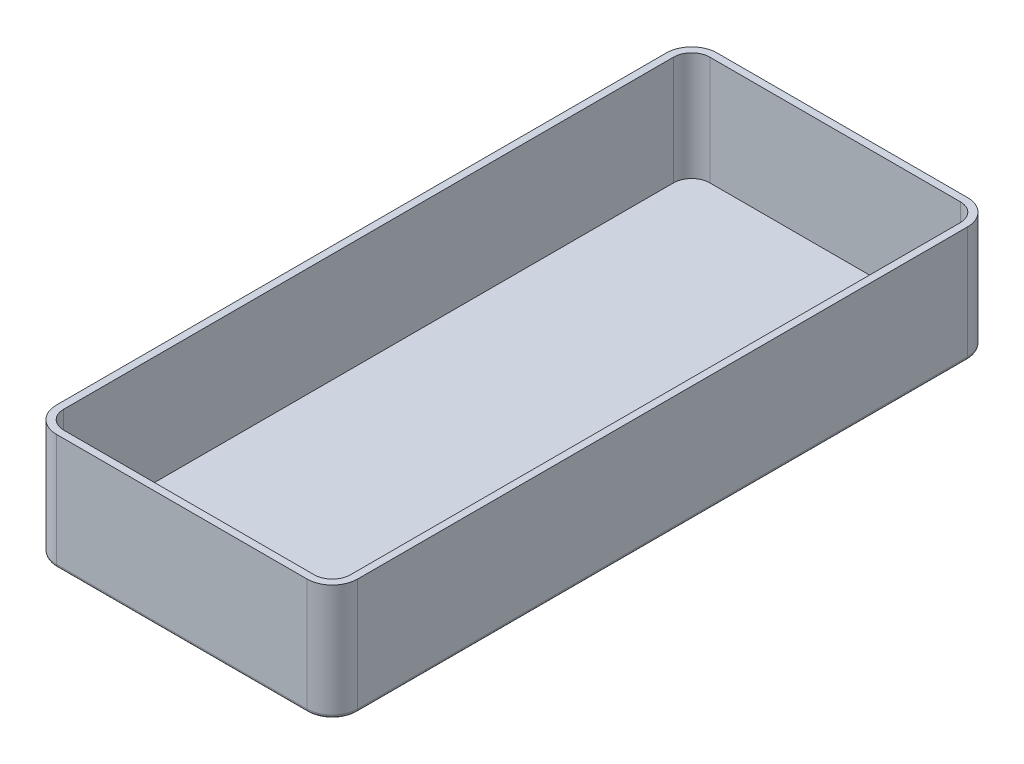
ISO-10303-21;
HEADER;
FILE_DESCRIPTION(('STEP AP214'),'2;1');
FILE_NAME('part.step','',(''),(''),'','','');
FILE_SCHEMA(('AUTOMOTIVE_DESIGN { 1 0 10303 214 1 1 1 1 }'));
ENDSEC;
DATA;
#1=APPLICATION_CONTEXT('core data for automotive mechanical design processes');
#2=APPLICATION_PROTOCOL_DEFINITION('international standard','automotive_design',2000,#1);
#3=PRODUCT_CONTEXT('',#1,'mechanical');
#4=PRODUCT('Part','Part','',(#3));
#5=PRODUCT_RELATED_PRODUCT_CATEGORY('part','',(#4));
#6=PRODUCT_DEFINITION_FORMATION('','',#4);
#7=PRODUCT_DEFINITION_CONTEXT('part definition',#1,'design');
#8=PRODUCT_DEFINITION('design','',#6,#7);
#9=PRODUCT_DEFINITION_SHAPE('','',#8);
#10=(LENGTH_UNIT() NAMED_UNIT(*) SI_UNIT(.MILLI.,.METRE.));
#11=(NAMED_UNIT(*) PLANE_ANGLE_UNIT() SI_UNIT($,.RADIAN.));
#12=(NAMED_UNIT(*) SI_UNIT($,.STERADIAN.) SOLID_ANGLE_UNIT());
#13=UNCERTAINTY_MEASURE_WITH_UNIT(LENGTH_MEASURE(1.E-05),#10,'distance_accuracy_value','');
#14=(GEOMETRIC_REPRESENTATION_CONTEXT(3) GLOBAL_UNCERTAINTY_ASSIGNED_CONTEXT((#13)) GLOBAL_UNIT_ASSIGNED_CONTEXT((#10,
#11,#12)) REPRESENTATION_CONTEXT('',''));
#15=CARTESIAN_POINT('',(0.,0.,0.));
#16=DIRECTION('',(0.,0.,1.));
#17=DIRECTION('',(1.,0.,0.));
#18=AXIS2_PLACEMENT_3D('',#15,#16,#17);
#19=CARTESIAN_POINT('',(-76.,32.,-6.99999999999999));
#20=DIRECTION('',(0.,-1.,0.));
#21=DIRECTION('',(0.,0.,-1.));
#22=AXIS2_PLACEMENT_3D('',#19,#20,#21);
#23=PLANE('',#22);
#24=CARTESIAN_POINT('',(-76.,32.,-6.99999999999999));
#25=DIRECTION('',(0.,1.,0.));
#26=DIRECTION('',(0.,0.,-1.));
#27=AXIS2_PLACEMENT_3D('',#24,#25,#26);
#28=CIRCLE('',#27,7.);
#29=CARTESIAN_POINT('',(-83.,32.,-7.00000000000004));
#30=VERTEX_POINT('',#29);
#31=CARTESIAN_POINT('',(-76.,32.,0.));
#32=VERTEX_POINT('',#31);
#33=EDGE_CURVE('E245',#30,#32,#28,.T.);
#34=ORIENTED_EDGE('',*,*,#33,.T.);
#35=DIRECTION('',(1.,0.,0.));
#36=VECTOR('',#35,1.);
#37=CARTESIAN_POINT('',(-7.00000000000005,32.,0.));
#38=LINE('',#37,#36);
#39=CARTESIAN_POINT('',(-7.00000000000005,32.,0.));
#40=VERTEX_POINT('',#39);
#41=EDGE_CURVE('E248',#32,#40,#38,.T.);
#42=ORIENTED_EDGE('',*,*,#41,.T.);
#43=CARTESIAN_POINT('',(-7.,32.,-7.));
#44=DIRECTION('',(0.,1.,0.));
#45=DIRECTION('',(0.,0.,1.));
#46=AXIS2_PLACEMENT_3D('',#43,#44,#45);
#47=CIRCLE('',#46,7.);
#48=CARTESIAN_POINT('',(0.,32.,-7.00000000000005));
#49=VERTEX_POINT('',#48);
#50=EDGE_CURVE('E250',#40,#49,#47,.T.);
#51=ORIENTED_EDGE('',*,*,#50,.T.);
#52=DIRECTION('',(0.,0.,-1.));
#53=VECTOR('',#52,1.);
#54=CARTESIAN_POINT('',(0.,32.,-7.00000000000005));
#55=LINE('',#54,#53);
#56=CARTESIAN_POINT('',(0.,32.,-175.));
#57=VERTEX_POINT('',#56);
#58=EDGE_CURVE('E252',#49,#57,#55,.T.);
#59=ORIENTED_EDGE('',*,*,#58,.T.);
#60=CARTESIAN_POINT('',(-7.,32.,-175.));
#61=DIRECTION('',(0.,1.,0.));
#62=DIRECTION('',(0.,0.,1.));
#63=AXIS2_PLACEMENT_3D('',#60,#61,#62);
#64=CIRCLE('',#63,7.);
#65=CARTESIAN_POINT('',(-7.00000000000005,32.,-182.));
#66=VERTEX_POINT('',#65);
#67=EDGE_CURVE('E254',#57,#66,#64,.T.);
#68=ORIENTED_EDGE('',*,*,#67,.T.);
#69=DIRECTION('',(-1.,0.,0.));
#70=VECTOR('',#69,1.);
#71=CARTESIAN_POINT('',(-7.00000000000005,32.,-182.));
#72=LINE('',#71,#70);
#73=CARTESIAN_POINT('',(-76.,32.,-182.));
#74=VERTEX_POINT('',#73);
#75=EDGE_CURVE('E256',#66,#74,#72,.T.);
#76=ORIENTED_EDGE('',*,*,#75,.T.);
#77=CARTESIAN_POINT('',(-76.,32.,-175.));
#78=DIRECTION('',(0.,1.,0.));
#79=DIRECTION('',(0.,0.,1.));
#80=AXIS2_PLACEMENT_3D('',#77,#78,#79);
#81=CIRCLE('',#80,7.00000000000001);
#82=CARTESIAN_POINT('',(-83.,32.,-175.));
#83=VERTEX_POINT('',#82);
#84=EDGE_CURVE('E258',#74,#83,#81,.T.);
#85=ORIENTED_EDGE('',*,*,#84,.T.);
#86=DIRECTION('',(0.,0.,1.));
#87=VECTOR('',#86,1.);
#88=CARTESIAN_POINT('',(-83.,32.,-7.00000000000004));
#89=LINE('',#88,#87);
#90=EDGE_CURVE('E260',#83,#30,#89,.T.);
#91=ORIENTED_EDGE('',*,*,#90,.T.);
#92=EDGE_LOOP('',(#34,#42,#51,#59,#68,#76,#85,#91));
#93=FACE_BOUND('',#92,.T.);
#94=CARTESIAN_POINT('',(-76.,32.,-6.99999999999999));
#95=DIRECTION('',(0.,-1.,0.));
#96=DIRECTION('',(0.,0.,-1.));
#97=AXIS2_PLACEMENT_3D('',#94,#95,#96);
#98=CIRCLE('',#97,5.);
#99=CARTESIAN_POINT('',(-81.,32.,-7.00000000000004));
#100=VERTEX_POINT('',#99);
#101=CARTESIAN_POINT('',(-76.,32.,-1.99999999999999));
#102=VERTEX_POINT('',#101);
#103=EDGE_CURVE('E232',#100,#102,#98,.F.);
#104=ORIENTED_EDGE('',*,*,#103,.F.);
#105=DIRECTION('',(0.,0.,1.));
#106=VECTOR('',#105,1.);
#107=CARTESIAN_POINT('',(-81.,32.,-6.99999999999999));
#108=LINE('',#107,#106);
#109=CARTESIAN_POINT('',(-81.,32.,-175.));
#110=VERTEX_POINT('',#109);
#111=EDGE_CURVE('E199',#110,#100,#108,.T.);
#112=ORIENTED_EDGE('',*,*,#111,.F.);
#113=CARTESIAN_POINT('',(-76.,32.,-175.));
#114=DIRECTION('',(0.,-1.,0.));
#115=DIRECTION('',(0.,0.,-1.));
#116=AXIS2_PLACEMENT_3D('',#113,#114,#115);
#117=CIRCLE('',#116,5.00000000000001);
#118=CARTESIAN_POINT('',(-76.,32.,-180.));
#119=VERTEX_POINT('',#118);
#120=EDGE_CURVE('E203',#119,#110,#117,.F.);
#121=ORIENTED_EDGE('',*,*,#120,.F.);
#122=DIRECTION('',(-1.,0.,0.));
#123=VECTOR('',#122,1.);
#124=CARTESIAN_POINT('',(-76.,32.,-180.));
#125=LINE('',#124,#123);
#126=CARTESIAN_POINT('',(-7.00000000000004,32.,-180.));
#127=VERTEX_POINT('',#126);
#128=EDGE_CURVE('E242',#127,#119,#125,.T.);
#129=ORIENTED_EDGE('',*,*,#128,.F.);
#130=CARTESIAN_POINT('',(-7.,32.,-175.));
#131=DIRECTION('',(0.,-1.,0.));
#132=DIRECTION('',(0.,0.,-1.));
#133=AXIS2_PLACEMENT_3D('',#130,#131,#132);
#134=CIRCLE('',#133,5.);
#135=CARTESIAN_POINT('',(-2.,32.,-175.));
#136=VERTEX_POINT('',#135);
#137=EDGE_CURVE('E240',#136,#127,#134,.F.);
#138=ORIENTED_EDGE('',*,*,#137,.F.);
#139=DIRECTION('',(0.,0.,-1.));
#140=VECTOR('',#139,1.);
#141=CARTESIAN_POINT('',(-2.,32.,-6.99999999999999));
#142=LINE('',#141,#140);
#143=CARTESIAN_POINT('',(-2.,32.,-7.00000000000003));
#144=VERTEX_POINT('',#143);
#145=EDGE_CURVE('E238',#144,#136,#142,.T.);
#146=ORIENTED_EDGE('',*,*,#145,.F.);
#147=CARTESIAN_POINT('',(-7.,32.,-7.));
#148=DIRECTION('',(0.,-1.,0.));
#149=DIRECTION('',(0.,0.,-1.));
#150=AXIS2_PLACEMENT_3D('',#147,#148,#149);
#151=CIRCLE('',#150,5.);
#152=CARTESIAN_POINT('',(-7.00000000000005,32.,-2.));
#153=VERTEX_POINT('',#152);
#154=EDGE_CURVE('E236',#153,#144,#151,.F.);
#155=ORIENTED_EDGE('',*,*,#154,.F.);
#156=DIRECTION('',(1.,0.,0.));
#157=VECTOR('',#156,1.);
#158=CARTESIAN_POINT('',(-76.,32.,-1.99999999999999));
#159=LINE('',#158,#157);
#160=EDGE_CURVE('E234',#102,#153,#159,.T.);
#161=ORIENTED_EDGE('',*,*,#160,.F.);
#162=EDGE_LOOP('',(#104,#112,#121,#129,#138,#146,#155,#161));
#163=FACE_BOUND('',#162,.T.);
#164=ADVANCED_FACE('F39',(#93,#163),#23,.F.);
#165=CARTESIAN_POINT('',(-76.,32.,-6.99999999999999));
#166=DIRECTION('',(0.,-1.,0.));
#167=DIRECTION('',(0.,0.,-1.));
#168=AXIS2_PLACEMENT_3D('',#165,#166,#167);
#169=CYLINDRICAL_SURFACE('',#168,7.);
#170=DIRECTION('',(0.,-1.,0.));
#171=VECTOR('',#170,1.);
#172=CARTESIAN_POINT('',(-83.,32.,-7.00000000000004));
#173=LINE('',#172,#171);
#174=CARTESIAN_POINT('',(-83.,1.,-7.00000000000004));
#175=VERTEX_POINT('',#174);
#176=EDGE_CURVE('E262',#30,#175,#173,.T.);
#177=ORIENTED_EDGE('',*,*,#176,.T.);
#178=CARTESIAN_POINT('',(-76.,1.,-6.99999999999999));
#179=DIRECTION('',(0.,-1.,0.));
#180=DIRECTION('',(0.,0.,-1.));
#181=AXIS2_PLACEMENT_3D('',#178,#179,#180);
#182=CIRCLE('',#181,7.);
#183=CARTESIAN_POINT('',(-76.,1.,0.));
#184=VERTEX_POINT('',#183);
#185=EDGE_CURVE('E284',#175,#184,#182,.F.);
#186=ORIENTED_EDGE('',*,*,#185,.T.);
#187=DIRECTION('',(0.,-1.,0.));
#188=VECTOR('',#187,1.);
#189=CARTESIAN_POINT('',(-76.,32.,0.));
#190=LINE('',#189,#188);
#191=EDGE_CURVE('E282',#32,#184,#190,.T.);
#192=ORIENTED_EDGE('',*,*,#191,.F.);
#193=ORIENTED_EDGE('',*,*,#33,.F.);
#194=EDGE_LOOP('',(#177,#186,#192,#193));
#195=FACE_BOUND('',#194,.T.);
#196=ADVANCED_FACE('F366',(#195),#169,.T.);
#197=CARTESIAN_POINT('',(-7.00000000000005,32.,0.));
#198=DIRECTION('',(0.,0.,-1.));
#199=DIRECTION('',(-1.,0.,0.));
#200=AXIS2_PLACEMENT_3D('',#197,#198,#199);
#201=PLANE('',#200);
#202=ORIENTED_EDGE('',*,*,#191,.T.);
#203=DIRECTION('',(1.,0.,0.));
#204=VECTOR('',#203,1.);
#205=CARTESIAN_POINT('',(-7.00000000000005,1.,0.));
#206=LINE('',#205,#204);
#207=CARTESIAN_POINT('',(-7.00000000000005,1.,0.));
#208=VERTEX_POINT('',#207);
#209=EDGE_CURVE('E11',#184,#208,#206,.T.);
#210=ORIENTED_EDGE('',*,*,#209,.T.);
#211=DIRECTION('',(0.,-1.,0.));
#212=VECTOR('',#211,1.);
#213=CARTESIAN_POINT('',(-7.00000000000005,32.,0.));
#214=LINE('',#213,#212);
#215=EDGE_CURVE('E280',#40,#208,#214,.T.);
#216=ORIENTED_EDGE('',*,*,#215,.F.);
#217=ORIENTED_EDGE('',*,*,#41,.F.);
#218=EDGE_LOOP('',(#202,#210,#216,#217));
#219=FACE_BOUND('',#218,.T.);
#220=ADVANCED_FACE('F412',(#219),#201,.F.);
#221=CARTESIAN_POINT('',(-7.,32.,-7.));
#222=DIRECTION('',(0.,-1.,0.));
#223=DIRECTION('',(0.,0.,-1.));
#224=AXIS2_PLACEMENT_3D('',#221,#222,#223);
#225=CYLINDRICAL_SURFACE('',#224,7.);
#226=ORIENTED_EDGE('',*,*,#215,.T.);
#227=CARTESIAN_POINT('',(-7.,1.,-7.));
#228=DIRECTION('',(0.,-1.,0.));
#229=DIRECTION('',(0.,0.,-1.));
#230=AXIS2_PLACEMENT_3D('',#227,#228,#229);
#231=CIRCLE('',#230,7.);
#232=CARTESIAN_POINT('',(0.,1.,-7.00000000000005));
#233=VERTEX_POINT('',#232);
#234=EDGE_CURVE('E48',#208,#233,#231,.F.);
#235=ORIENTED_EDGE('',*,*,#234,.T.);
#236=DIRECTION('',(0.,-1.,0.));
#237=VECTOR('',#236,1.);
#238=CARTESIAN_POINT('',(0.,32.,-7.00000000000005));
#239=LINE('',#238,#237);
#240=EDGE_CURVE('E277',#49,#233,#239,.T.);
#241=ORIENTED_EDGE('',*,*,#240,.F.);
#242=ORIENTED_EDGE('',*,*,#50,.F.);
#243=EDGE_LOOP('',(#226,#235,#241,#242));
#244=FACE_BOUND('',#243,.T.);
#245=ADVANCED_FACE('F429',(#244),#225,.T.);
#246=CARTESIAN_POINT('',(0.,32.,-7.00000000000005));
#247=DIRECTION('',(-1.,0.,0.));
#248=DIRECTION('',(0.,0.,1.));
#249=AXIS2_PLACEMENT_3D('',#246,#247,#248);
#250=PLANE('',#249);
#251=ORIENTED_EDGE('',*,*,#240,.T.);
#252=DIRECTION('',(0.,0.,-1.));
#253=VECTOR('',#252,1.);
#254=CARTESIAN_POINT('',(0.,1.,-175.));
#255=LINE('',#254,#253);
#256=CARTESIAN_POINT('',(0.,1.,-175.));
#257=VERTEX_POINT('',#256);
#258=EDGE_CURVE('E312',#233,#257,#255,.T.);
#259=ORIENTED_EDGE('',*,*,#258,.T.);
#260=DIRECTION('',(0.,-1.,0.));
#261=VECTOR('',#260,1.);
#262=CARTESIAN_POINT('',(0.,32.,-175.));
#263=LINE('',#262,#261);
#264=EDGE_CURVE('E274',#57,#257,#263,.T.);
#265=ORIENTED_EDGE('',*,*,#264,.F.);
#266=ORIENTED_EDGE('',*,*,#58,.F.);
#267=EDGE_LOOP('',(#251,#259,#265,#266));
#268=FACE_BOUND('',#267,.T.);
#269=ADVANCED_FACE('F384',(#268),#250,.F.);
#270=CARTESIAN_POINT('',(-7.,32.,-175.));
#271=DIRECTION('',(0.,-1.,0.));
#272=DIRECTION('',(0.,0.,-1.));
#273=AXIS2_PLACEMENT_3D('',#270,#271,#272);
#274=CYLINDRICAL_SURFACE('',#273,7.);
#275=ORIENTED_EDGE('',*,*,#264,.T.);
#276=CARTESIAN_POINT('',(-7.,1.,-175.));
#277=DIRECTION('',(0.,-1.,0.));
#278=DIRECTION('',(0.,0.,-1.));
#279=AXIS2_PLACEMENT_3D('',#276,#277,#278);
#280=CIRCLE('',#279,7.);
#281=CARTESIAN_POINT('',(-7.00000000000005,1.,-182.));
#282=VERTEX_POINT('',#281);
#283=EDGE_CURVE('E310',#257,#282,#280,.F.);
#284=ORIENTED_EDGE('',*,*,#283,.T.);
#285=DIRECTION('',(0.,-1.,0.));
#286=VECTOR('',#285,1.);
#287=CARTESIAN_POINT('',(-7.00000000000005,32.,-182.));
#288=LINE('',#287,#286);
#289=EDGE_CURVE('E271',#66,#282,#288,.T.);
#290=ORIENTED_EDGE('',*,*,#289,.F.);
#291=ORIENTED_EDGE('',*,*,#67,.F.);
#292=EDGE_LOOP('',(#275,#284,#290,#291));
#293=FACE_BOUND('',#292,.T.);
#294=ADVANCED_FACE('F380',(#293),#274,.T.);
#295=CARTESIAN_POINT('',(-7.00000000000005,32.,-182.));
#296=DIRECTION('',(0.,0.,1.));
#297=DIRECTION('',(1.,0.,0.));
#298=AXIS2_PLACEMENT_3D('',#295,#296,#297);
#299=PLANE('',#298);
#300=ORIENTED_EDGE('',*,*,#289,.T.);
#301=DIRECTION('',(-1.,0.,0.));
#302=VECTOR('',#301,1.);
#303=CARTESIAN_POINT('',(-76.,1.,-182.));
#304=LINE('',#303,#302);
#305=CARTESIAN_POINT('',(-76.,1.,-182.));
#306=VERTEX_POINT('',#305);
#307=EDGE_CURVE('E308',#282,#306,#304,.T.);
#308=ORIENTED_EDGE('',*,*,#307,.T.);
#309=DIRECTION('',(0.,-1.,0.));
#310=VECTOR('',#309,1.);
#311=CARTESIAN_POINT('',(-76.,32.,-182.));
#312=LINE('',#311,#310);
#313=EDGE_CURVE('E268',#74,#306,#312,.T.);
#314=ORIENTED_EDGE('',*,*,#313,.F.);
#315=ORIENTED_EDGE('',*,*,#75,.F.);
#316=EDGE_LOOP('',(#300,#308,#314,#315));
#317=FACE_BOUND('',#316,.T.);
#318=ADVANCED_FACE('F376',(#317),#299,.F.);
#319=CARTESIAN_POINT('',(-76.,32.,-175.));
#320=DIRECTION('',(0.,-1.,0.));
#321=DIRECTION('',(0.,0.,-1.));
#322=AXIS2_PLACEMENT_3D('',#319,#320,#321);
#323=CYLINDRICAL_SURFACE('',#322,7.00000000000001);
#324=ORIENTED_EDGE('',*,*,#313,.T.);
#325=CARTESIAN_POINT('',(-76.,1.,-175.));
#326=DIRECTION('',(0.,-1.,0.));
#327=DIRECTION('',(0.,0.,-1.));
#328=AXIS2_PLACEMENT_3D('',#325,#326,#327);
#329=CIRCLE('',#328,7.00000000000001);
#330=CARTESIAN_POINT('',(-83.,1.,-175.));
#331=VERTEX_POINT('',#330);
#332=EDGE_CURVE('E306',#306,#331,#329,.F.);
#333=ORIENTED_EDGE('',*,*,#332,.T.);
#334=DIRECTION('',(0.,-1.,0.));
#335=VECTOR('',#334,1.);
#336=CARTESIAN_POINT('',(-83.,32.,-175.));
#337=LINE('',#336,#335);
#338=EDGE_CURVE('E265',#83,#331,#337,.T.);
#339=ORIENTED_EDGE('',*,*,#338,.F.);
#340=ORIENTED_EDGE('',*,*,#84,.F.);
#341=EDGE_LOOP('',(#324,#333,#339,#340));
#342=FACE_BOUND('',#341,.T.);
#343=ADVANCED_FACE('F374',(#342),#323,.T.);
#344=CARTESIAN_POINT('',(-83.,32.,-7.00000000000004));
#345=DIRECTION('',(1.,0.,0.));
#346=DIRECTION('',(0.,0.,-1.));
#347=AXIS2_PLACEMENT_3D('',#344,#345,#346);
#348=PLANE('',#347);
#349=ORIENTED_EDGE('',*,*,#338,.T.);
#350=DIRECTION('',(0.,0.,1.));
#351=VECTOR('',#350,1.);
#352=CARTESIAN_POINT('',(-83.,1.,-7.00000000000004));
#353=LINE('',#352,#351);
#354=EDGE_CURVE('E304',#331,#175,#353,.T.);
#355=ORIENTED_EDGE('',*,*,#354,.T.);
#356=ORIENTED_EDGE('',*,*,#176,.F.);
#357=ORIENTED_EDGE('',*,*,#90,.F.);
#358=EDGE_LOOP('',(#349,#355,#356,#357));
#359=FACE_BOUND('',#358,.T.);
#360=ADVANCED_FACE('F361',(#359),#348,.F.);
#361=CARTESIAN_POINT('',(-76.,0.,-6.99999999999999));
#362=DIRECTION('',(0.,-1.,0.));
#363=DIRECTION('',(0.,0.,-1.));
#364=AXIS2_PLACEMENT_3D('',#361,#362,#363);
#365=PLANE('',#364);
#366=DIRECTION('',(1.,0.,0.));
#367=VECTOR('',#366,1.);
#368=CARTESIAN_POINT('',(-76.,0.,-0.999999999999991));
#369=LINE('',#368,#367);
#370=CARTESIAN_POINT('',(-7.00000000000004,0.,-0.999999999999999));
#371=VERTEX_POINT('',#370);
#372=CARTESIAN_POINT('',(-76.,0.,-0.999999999999991));
#373=VERTEX_POINT('',#372);
#374=EDGE_CURVE('E287',#371,#373,#369,.F.);
#375=ORIENTED_EDGE('',*,*,#374,.T.);
#376=CARTESIAN_POINT('',(-76.,0.,-6.99999999999999));
#377=DIRECTION('',(0.,-1.,0.));
#378=DIRECTION('',(0.,0.,-1.));
#379=AXIS2_PLACEMENT_3D('',#376,#377,#378);
#380=CIRCLE('',#379,6.);
#381=CARTESIAN_POINT('',(-82.,0.,-7.00000000000003));
#382=VERTEX_POINT('',#381);
#383=EDGE_CURVE('E301',#373,#382,#380,.T.);
#384=ORIENTED_EDGE('',*,*,#383,.T.);
#385=DIRECTION('',(0.,0.,1.));
#386=VECTOR('',#385,1.);
#387=CARTESIAN_POINT('',(-82.,0.,-175.));
#388=LINE('',#387,#386);
#389=CARTESIAN_POINT('',(-82.,0.,-175.));
#390=VERTEX_POINT('',#389);
#391=EDGE_CURVE('E299',#382,#390,#388,.F.);
#392=ORIENTED_EDGE('',*,*,#391,.T.);
#393=CARTESIAN_POINT('',(-76.,0.,-175.));
#394=DIRECTION('',(0.,-1.,0.));
#395=DIRECTION('',(0.,0.,-1.));
#396=AXIS2_PLACEMENT_3D('',#393,#394,#395);
#397=CIRCLE('',#396,6.00000000000001);
#398=CARTESIAN_POINT('',(-76.,0.,-181.));
#399=VERTEX_POINT('',#398);
#400=EDGE_CURVE('E297',#390,#399,#397,.T.);
#401=ORIENTED_EDGE('',*,*,#400,.T.);
#402=DIRECTION('',(-1.,0.,0.));
#403=VECTOR('',#402,1.);
#404=CARTESIAN_POINT('',(-7.00000000000005,0.,-181.));
#405=LINE('',#404,#403);
#406=CARTESIAN_POINT('',(-7.00000000000005,0.,-181.));
#407=VERTEX_POINT('',#406);
#408=EDGE_CURVE('E295',#399,#407,#405,.F.);
#409=ORIENTED_EDGE('',*,*,#408,.T.);
#410=CARTESIAN_POINT('',(-7.,0.,-175.));
#411=DIRECTION('',(0.,-1.,0.));
#412=DIRECTION('',(0.,0.,-1.));
#413=AXIS2_PLACEMENT_3D('',#410,#411,#412);
#414=CIRCLE('',#413,6.);
#415=CARTESIAN_POINT('',(-1.,0.,-175.));
#416=VERTEX_POINT('',#415);
#417=EDGE_CURVE('E293',#407,#416,#414,.T.);
#418=ORIENTED_EDGE('',*,*,#417,.T.);
#419=DIRECTION('',(0.,0.,-1.));
#420=VECTOR('',#419,1.);
#421=CARTESIAN_POINT('',(-1.,0.,-7.00000000000005));
#422=LINE('',#421,#420);
#423=CARTESIAN_POINT('',(-1.,0.,-7.00000000000005));
#424=VERTEX_POINT('',#423);
#425=EDGE_CURVE('E291',#416,#424,#422,.F.);
#426=ORIENTED_EDGE('',*,*,#425,.T.);
#427=CARTESIAN_POINT('',(-7.,0.,-7.));
#428=DIRECTION('',(0.,-1.,0.));
#429=DIRECTION('',(0.,0.,-1.));
#430=AXIS2_PLACEMENT_3D('',#427,#428,#429);
#431=CIRCLE('',#430,6.);
#432=EDGE_CURVE('E289',#424,#371,#431,.T.);
#433=ORIENTED_EDGE('',*,*,#432,.T.);
#434=EDGE_LOOP('',(#375,#384,#392,#401,#409,#418,#426,#433));
#435=FACE_BOUND('',#434,.T.);
#436=ADVANCED_FACE('F346',(#435),#365,.T.);
#437=CARTESIAN_POINT('',(-7.,1.,-175.));
#438=DIRECTION('',(0.,-1.,0.));
#439=DIRECTION('',(0.,0.,-1.));
#440=AXIS2_PLACEMENT_3D('',#437,#438,#439);
#441=TOROIDAL_SURFACE('',#440,6.,1.);
#442=CARTESIAN_POINT('',(-0.999999999999997,1.,-175.));
#443=DIRECTION('',(0.,0.,1.));
#444=DIRECTION('',(1.,0.,0.));
#445=AXIS2_PLACEMENT_3D('',#442,#443,#444);
#446=CIRCLE('',#445,1.);
#447=EDGE_CURVE('E329',#416,#257,#446,.T.);
#448=ORIENTED_EDGE('',*,*,#447,.F.);
#449=ORIENTED_EDGE('',*,*,#417,.F.);
#450=CARTESIAN_POINT('',(-7.00000000000004,1.,-181.));
#451=DIRECTION('',(-1.,0.,0.));
#452=DIRECTION('',(0.,0.,1.));
#453=AXIS2_PLACEMENT_3D('',#450,#451,#452);
#454=CIRCLE('',#453,1.);
#455=EDGE_CURVE('E43',#282,#407,#454,.T.);
#456=ORIENTED_EDGE('',*,*,#455,.F.);
#457=ORIENTED_EDGE('',*,*,#283,.F.);
#458=EDGE_LOOP('',(#448,#449,#456,#457));
#459=FACE_BOUND('',#458,.T.);
#460=ADVANCED_FACE('F41',(#459),#441,.T.);
#461=CARTESIAN_POINT('',(-7.00000000000005,1.,-181.));
#462=DIRECTION('',(1.,0.,0.));
#463=DIRECTION('',(0.,0.,-1.));
#464=AXIS2_PLACEMENT_3D('',#461,#462,#463);
#465=CYLINDRICAL_SURFACE('',#464,1.);
#466=ORIENTED_EDGE('',*,*,#455,.T.);
#467=ORIENTED_EDGE('',*,*,#408,.F.);
#468=CARTESIAN_POINT('',(-76.,1.,-181.));
#469=DIRECTION('',(-1.,0.,0.));
#470=DIRECTION('',(0.,0.,1.));
#471=AXIS2_PLACEMENT_3D('',#468,#469,#470);
#472=CIRCLE('',#471,1.);
#473=EDGE_CURVE('E327',#306,#399,#472,.T.);
#474=ORIENTED_EDGE('',*,*,#473,.F.);
#475=ORIENTED_EDGE('',*,*,#307,.F.);
#476=EDGE_LOOP('',(#466,#467,#474,#475));
#477=FACE_BOUND('',#476,.T.);
#478=ADVANCED_FACE('F340',(#477),#465,.T.);
#479=CARTESIAN_POINT('',(-1.,1.,-7.00000000000005));
#480=DIRECTION('',(0.,0.,1.));
#481=DIRECTION('',(1.,0.,0.));
#482=AXIS2_PLACEMENT_3D('',#479,#480,#481);
#483=CYLINDRICAL_SURFACE('',#482,1.);
#484=ORIENTED_EDGE('',*,*,#447,.T.);
#485=ORIENTED_EDGE('',*,*,#258,.F.);
#486=CARTESIAN_POINT('',(-1.,1.,-7.00000000000005));
#487=DIRECTION('',(0.,0.,1.));
#488=DIRECTION('',(1.,0.,0.));
#489=AXIS2_PLACEMENT_3D('',#486,#487,#488);
#490=CIRCLE('',#489,1.);
#491=EDGE_CURVE('E324',#424,#233,#490,.T.);
#492=ORIENTED_EDGE('',*,*,#491,.F.);
#493=ORIENTED_EDGE('',*,*,#425,.F.);
#494=EDGE_LOOP('',(#484,#485,#492,#493));
#495=FACE_BOUND('',#494,.T.);
#496=ADVANCED_FACE('F386',(#495),#483,.T.);
#497=CARTESIAN_POINT('',(-76.,1.,-175.));
#498=DIRECTION('',(0.,-1.,0.));
#499=DIRECTION('',(0.,0.,-1.));
#500=AXIS2_PLACEMENT_3D('',#497,#498,#499);
#501=TOROIDAL_SURFACE('',#500,6.00000000000001,1.);
#502=ORIENTED_EDGE('',*,*,#473,.T.);
#503=ORIENTED_EDGE('',*,*,#400,.F.);
#504=CARTESIAN_POINT('',(-82.,1.,-175.));
#505=DIRECTION('',(0.,0.,1.));
#506=DIRECTION('',(1.,0.,0.));
#507=AXIS2_PLACEMENT_3D('',#504,#505,#506);
#508=CIRCLE('',#507,1.);
#509=EDGE_CURVE('E321',#331,#390,#508,.T.);
#510=ORIENTED_EDGE('',*,*,#509,.F.);
#511=ORIENTED_EDGE('',*,*,#332,.F.);
#512=EDGE_LOOP('',(#502,#503,#510,#511));
#513=FACE_BOUND('',#512,.T.);
#514=ADVANCED_FACE('F352',(#513),#501,.T.);
#515=CARTESIAN_POINT('',(-7.,1.,-7.));
#516=DIRECTION('',(0.,-1.,0.));
#517=DIRECTION('',(0.,0.,-1.));
#518=AXIS2_PLACEMENT_3D('',#515,#516,#517);
#519=TOROIDAL_SURFACE('',#518,6.,1.);
#520=ORIENTED_EDGE('',*,*,#491,.T.);
#521=ORIENTED_EDGE('',*,*,#234,.F.);
#522=CARTESIAN_POINT('',(-7.00000000000004,1.,-0.999999999999999));
#523=DIRECTION('',(-1.,0.,0.));
#524=DIRECTION('',(0.,0.,1.));
#525=AXIS2_PLACEMENT_3D('',#522,#523,#524);
#526=CIRCLE('',#525,1.);
#527=EDGE_CURVE('E318',#371,#208,#526,.T.);
#528=ORIENTED_EDGE('',*,*,#527,.F.);
#529=ORIENTED_EDGE('',*,*,#432,.F.);
#530=EDGE_LOOP('',(#520,#521,#528,#529));
#531=FACE_BOUND('',#530,.T.);
#532=ADVANCED_FACE('F390',(#531),#519,.T.);
#533=CARTESIAN_POINT('',(-82.,1.,-7.00000000000004));
#534=DIRECTION('',(0.,0.,-1.));
#535=DIRECTION('',(-1.,0.,0.));
#536=AXIS2_PLACEMENT_3D('',#533,#534,#535);
#537=CYLINDRICAL_SURFACE('',#536,1.);
#538=ORIENTED_EDGE('',*,*,#509,.T.);
#539=ORIENTED_EDGE('',*,*,#391,.F.);
#540=CARTESIAN_POINT('',(-82.,1.,-7.00000000000004));
#541=DIRECTION('',(0.,0.,1.));
#542=DIRECTION('',(0.,-1.,0.));
#543=AXIS2_PLACEMENT_3D('',#540,#541,#542);
#544=CIRCLE('',#543,1.);
#545=EDGE_CURVE('E316',#175,#382,#544,.T.);
#546=ORIENTED_EDGE('',*,*,#545,.F.);
#547=ORIENTED_EDGE('',*,*,#354,.F.);
#548=EDGE_LOOP('',(#538,#539,#546,#547));
#549=FACE_BOUND('',#548,.T.);
#550=ADVANCED_FACE('F356',(#549),#537,.T.);
#551=CARTESIAN_POINT('',(-7.00000000000005,1.,-0.999999999999999));
#552=DIRECTION('',(-1.,0.,0.));
#553=DIRECTION('',(0.,0.,1.));
#554=AXIS2_PLACEMENT_3D('',#551,#552,#553);
#555=CYLINDRICAL_SURFACE('',#554,1.);
#556=ORIENTED_EDGE('',*,*,#527,.T.);
#557=ORIENTED_EDGE('',*,*,#209,.F.);
#558=CARTESIAN_POINT('',(-76.,1.,-0.999999999999991));
#559=DIRECTION('',(-1.,0.,0.));
#560=DIRECTION('',(0.,0.,1.));
#561=AXIS2_PLACEMENT_3D('',#558,#559,#560);
#562=CIRCLE('',#561,1.);
#563=EDGE_CURVE('E211',#373,#184,#562,.T.);
#564=ORIENTED_EDGE('',*,*,#563,.F.);
#565=ORIENTED_EDGE('',*,*,#374,.F.);
#566=EDGE_LOOP('',(#556,#557,#564,#565));
#567=FACE_BOUND('',#566,.T.);
#568=ADVANCED_FACE('F398',(#567),#555,.T.);
#569=CARTESIAN_POINT('',(-76.,1.,-6.99999999999999));
#570=DIRECTION('',(0.,-1.,0.));
#571=DIRECTION('',(0.,0.,-1.));
#572=AXIS2_PLACEMENT_3D('',#569,#570,#571);
#573=TOROIDAL_SURFACE('',#572,6.,1.);
#574=ORIENTED_EDGE('',*,*,#545,.T.);
#575=ORIENTED_EDGE('',*,*,#383,.F.);
#576=ORIENTED_EDGE('',*,*,#563,.T.);
#577=ORIENTED_EDGE('',*,*,#185,.F.);
#578=EDGE_LOOP('',(#574,#575,#576,#577));
#579=FACE_BOUND('',#578,.T.);
#580=ADVANCED_FACE('F397',(#579),#573,.T.);
#581=CARTESIAN_POINT('',(-76.,32.,-6.99999999999999));
#582=DIRECTION('',(0.,-1.,0.));
#583=DIRECTION('',(0.,0.,-1.));
#584=AXIS2_PLACEMENT_3D('',#581,#582,#583);
#585=CYLINDRICAL_SURFACE('',#584,5.);
#586=DIRECTION('',(0.,-1.,0.));
#587=VECTOR('',#586,1.);
#588=CARTESIAN_POINT('',(-81.,32.,-7.00000000000002));
#589=LINE('',#588,#587);
#590=CARTESIAN_POINT('',(-81.,2.,-7.00000000000002));
#591=VERTEX_POINT('',#590);
#592=EDGE_CURVE('E182',#100,#591,#589,.T.);
#593=ORIENTED_EDGE('',*,*,#592,.F.);
#594=ORIENTED_EDGE('',*,*,#103,.T.);
#595=DIRECTION('',(0.,1.,0.));
#596=VECTOR('',#595,1.);
#597=CARTESIAN_POINT('',(-76.,32.,-1.99999999999999));
#598=LINE('',#597,#596);
#599=CARTESIAN_POINT('',(-76.,2.,-1.99999999999999));
#600=VERTEX_POINT('',#599);
#601=EDGE_CURVE('E185',#102,#600,#598,.F.);
#602=ORIENTED_EDGE('',*,*,#601,.T.);
#603=CARTESIAN_POINT('',(-76.,2.,-6.99999999999999));
#604=DIRECTION('',(0.,-1.,0.));
#605=DIRECTION('',(0.,0.,-1.));
#606=AXIS2_PLACEMENT_3D('',#603,#604,#605);
#607=CIRCLE('',#606,5.);
#608=EDGE_CURVE('E178',#600,#591,#607,.T.);
#609=ORIENTED_EDGE('',*,*,#608,.T.);
#610=EDGE_LOOP('',(#593,#594,#602,#609));
#611=FACE_BOUND('',#610,.T.);
#612=ADVANCED_FACE('F180',(#611),#585,.F.);
#613=CARTESIAN_POINT('',(-7.00000000000005,32.,-2.));
#614=DIRECTION('',(0.,0.,-1.));
#615=DIRECTION('',(-1.,0.,0.));
#616=AXIS2_PLACEMENT_3D('',#613,#614,#615);
#617=PLANE('',#616);
#618=ORIENTED_EDGE('',*,*,#601,.F.);
#619=ORIENTED_EDGE('',*,*,#160,.T.);
#620=DIRECTION('',(0.,-1.,0.));
#621=VECTOR('',#620,1.);
#622=CARTESIAN_POINT('',(-7.00000000000003,32.,-2.));
#623=LINE('',#622,#621);
#624=CARTESIAN_POINT('',(-7.00000000000003,2.,-2.));
#625=VERTEX_POINT('',#624);
#626=EDGE_CURVE('E208',#153,#625,#623,.T.);
#627=ORIENTED_EDGE('',*,*,#626,.T.);
#628=DIRECTION('',(1.,0.,0.));
#629=VECTOR('',#628,1.);
#630=CARTESIAN_POINT('',(-76.,2.,-1.99999999999999));
#631=LINE('',#630,#629);
#632=EDGE_CURVE('E209',#600,#625,#631,.T.);
#633=ORIENTED_EDGE('',*,*,#632,.F.);
#634=EDGE_LOOP('',(#618,#619,#627,#633));
#635=FACE_BOUND('',#634,.T.);
#636=ADVANCED_FACE('F522',(#635),#617,.T.);
#637=CARTESIAN_POINT('',(-7.,32.,-7.));
#638=DIRECTION('',(0.,-1.,0.));
#639=DIRECTION('',(0.,0.,-1.));
#640=AXIS2_PLACEMENT_3D('',#637,#638,#639);
#641=CYLINDRICAL_SURFACE('',#640,5.);
#642=ORIENTED_EDGE('',*,*,#626,.F.);
#643=ORIENTED_EDGE('',*,*,#154,.T.);
#644=DIRECTION('',(0.,1.,0.));
#645=VECTOR('',#644,1.);
#646=CARTESIAN_POINT('',(-2.,32.,-7.00000000000005));
#647=LINE('',#646,#645);
#648=CARTESIAN_POINT('',(-2.,2.,-7.00000000000005));
#649=VERTEX_POINT('',#648);
#650=EDGE_CURVE('E214',#144,#649,#647,.F.);
#651=ORIENTED_EDGE('',*,*,#650,.T.);
#652=CARTESIAN_POINT('',(-7.,2.,-7.));
#653=DIRECTION('',(0.,-1.,0.));
#654=DIRECTION('',(0.,0.,-1.));
#655=AXIS2_PLACEMENT_3D('',#652,#653,#654);
#656=CIRCLE('',#655,5.);
#657=EDGE_CURVE('E212',#625,#649,#656,.F.);
#658=ORIENTED_EDGE('',*,*,#657,.F.);
#659=EDGE_LOOP('',(#642,#643,#651,#658));
#660=FACE_BOUND('',#659,.T.);
#661=ADVANCED_FACE('F531',(#660),#641,.F.);
#662=CARTESIAN_POINT('',(-2.,32.,-7.00000000000005));
#663=DIRECTION('',(-1.,0.,0.));
#664=DIRECTION('',(0.,0.,1.));
#665=AXIS2_PLACEMENT_3D('',#662,#663,#664);
#666=PLANE('',#665);
#667=ORIENTED_EDGE('',*,*,#650,.F.);
#668=ORIENTED_EDGE('',*,*,#145,.T.);
#669=DIRECTION('',(0.,-1.,0.));
#670=VECTOR('',#669,1.);
#671=CARTESIAN_POINT('',(-2.,32.,-175.));
#672=LINE('',#671,#670);
#673=CARTESIAN_POINT('',(-2.,2.,-175.));
#674=VERTEX_POINT('',#673);
#675=EDGE_CURVE('E218',#136,#674,#672,.T.);
#676=ORIENTED_EDGE('',*,*,#675,.T.);
#677=DIRECTION('',(0.,0.,-1.));
#678=VECTOR('',#677,1.);
#679=CARTESIAN_POINT('',(-2.,2.,-6.99999999999999));
#680=LINE('',#679,#678);
#681=EDGE_CURVE('E189',#649,#674,#680,.T.);
#682=ORIENTED_EDGE('',*,*,#681,.F.);
#683=EDGE_LOOP('',(#667,#668,#676,#682));
#684=FACE_BOUND('',#683,.T.);
#685=ADVANCED_FACE('F541',(#684),#666,.T.);
#686=CARTESIAN_POINT('',(-7.,32.,-175.));
#687=DIRECTION('',(0.,-1.,0.));
#688=DIRECTION('',(0.,0.,-1.));
#689=AXIS2_PLACEMENT_3D('',#686,#687,#688);
#690=CYLINDRICAL_SURFACE('',#689,5.);
#691=ORIENTED_EDGE('',*,*,#675,.F.);
#692=ORIENTED_EDGE('',*,*,#137,.T.);
#693=DIRECTION('',(0.,1.,0.));
#694=VECTOR('',#693,1.);
#695=CARTESIAN_POINT('',(-7.00000000000005,32.,-180.));
#696=LINE('',#695,#694);
#697=CARTESIAN_POINT('',(-7.00000000000005,2.,-180.));
#698=VERTEX_POINT('',#697);
#699=EDGE_CURVE('E222',#127,#698,#696,.F.);
#700=ORIENTED_EDGE('',*,*,#699,.T.);
#701=CARTESIAN_POINT('',(-7.,2.,-175.));
#702=DIRECTION('',(0.,-1.,0.));
#703=DIRECTION('',(0.,0.,-1.));
#704=AXIS2_PLACEMENT_3D('',#701,#702,#703);
#705=CIRCLE('',#704,5.);
#706=EDGE_CURVE('E207',#698,#674,#705,.T.);
#707=ORIENTED_EDGE('',*,*,#706,.T.);
#708=EDGE_LOOP('',(#691,#692,#700,#707));
#709=FACE_BOUND('',#708,.T.);
#710=ADVANCED_FACE('F551',(#709),#690,.F.);
#711=CARTESIAN_POINT('',(-7.00000000000005,32.,-180.));
#712=DIRECTION('',(0.,0.,1.));
#713=DIRECTION('',(1.,0.,0.));
#714=AXIS2_PLACEMENT_3D('',#711,#712,#713);
#715=PLANE('',#714);
#716=ORIENTED_EDGE('',*,*,#699,.F.);
#717=ORIENTED_EDGE('',*,*,#128,.T.);
#718=DIRECTION('',(0.,-1.,0.));
#719=VECTOR('',#718,1.);
#720=CARTESIAN_POINT('',(-76.,32.,-180.));
#721=LINE('',#720,#719);
#722=CARTESIAN_POINT('',(-76.,2.,-180.));
#723=VERTEX_POINT('',#722);
#724=EDGE_CURVE('E201',#119,#723,#721,.T.);
#725=ORIENTED_EDGE('',*,*,#724,.T.);
#726=DIRECTION('',(1.,0.,0.));
#727=VECTOR('',#726,1.);
#728=CARTESIAN_POINT('',(-7.00000000000005,2.,-180.));
#729=LINE('',#728,#727);
#730=EDGE_CURVE('E225',#723,#698,#729,.T.);
#731=ORIENTED_EDGE('',*,*,#730,.T.);
#732=EDGE_LOOP('',(#716,#717,#725,#731));
#733=FACE_BOUND('',#732,.T.);
#734=ADVANCED_FACE('F561',(#733),#715,.T.);
#735=CARTESIAN_POINT('',(-76.,32.,-175.));
#736=DIRECTION('',(0.,-1.,0.));
#737=DIRECTION('',(0.,0.,-1.));
#738=AXIS2_PLACEMENT_3D('',#735,#736,#737);
#739=CYLINDRICAL_SURFACE('',#738,5.00000000000001);
#740=ORIENTED_EDGE('',*,*,#724,.F.);
#741=ORIENTED_EDGE('',*,*,#120,.T.);
#742=DIRECTION('',(0.,1.,0.));
#743=VECTOR('',#742,1.);
#744=CARTESIAN_POINT('',(-81.,32.,-175.));
#745=LINE('',#744,#743);
#746=CARTESIAN_POINT('',(-81.,2.,-175.));
#747=VERTEX_POINT('',#746);
#748=EDGE_CURVE('E56',#110,#747,#745,.F.);
#749=ORIENTED_EDGE('',*,*,#748,.T.);
#750=CARTESIAN_POINT('',(-76.,2.,-175.));
#751=DIRECTION('',(0.,-1.,0.));
#752=DIRECTION('',(0.,0.,-1.));
#753=AXIS2_PLACEMENT_3D('',#750,#751,#752);
#754=CIRCLE('',#753,5.00000000000001);
#755=EDGE_CURVE('E195',#747,#723,#754,.T.);
#756=ORIENTED_EDGE('',*,*,#755,.T.);
#757=EDGE_LOOP('',(#740,#741,#749,#756));
#758=FACE_BOUND('',#757,.T.);
#759=ADVANCED_FACE('F571',(#758),#739,.F.);
#760=CARTESIAN_POINT('',(-81.,32.,-7.00000000000004));
#761=DIRECTION('',(1.,0.,0.));
#762=DIRECTION('',(0.,0.,-1.));
#763=AXIS2_PLACEMENT_3D('',#760,#761,#762);
#764=PLANE('',#763);
#765=ORIENTED_EDGE('',*,*,#748,.F.);
#766=ORIENTED_EDGE('',*,*,#111,.T.);
#767=ORIENTED_EDGE('',*,*,#592,.T.);
#768=DIRECTION('',(0.,0.,-1.));
#769=VECTOR('',#768,1.);
#770=CARTESIAN_POINT('',(-81.,2.,-7.00000000000004));
#771=LINE('',#770,#769);
#772=EDGE_CURVE('E190',#591,#747,#771,.T.);
#773=ORIENTED_EDGE('',*,*,#772,.T.);
#774=EDGE_LOOP('',(#765,#766,#767,#773));
#775=FACE_BOUND('',#774,.T.);
#776=ADVANCED_FACE('F197',(#775),#764,.T.);
#777=CARTESIAN_POINT('',(-76.,2.,-6.99999999999999));
#778=DIRECTION('',(0.,-1.,0.));
#779=DIRECTION('',(0.,0.,-1.));
#780=AXIS2_PLACEMENT_3D('',#777,#778,#779);
#781=PLANE('',#780);
#782=ORIENTED_EDGE('',*,*,#632,.T.);
#783=ORIENTED_EDGE('',*,*,#657,.T.);
#784=ORIENTED_EDGE('',*,*,#681,.T.);
#785=ORIENTED_EDGE('',*,*,#706,.F.);
#786=ORIENTED_EDGE('',*,*,#730,.F.);
#787=ORIENTED_EDGE('',*,*,#755,.F.);
#788=ORIENTED_EDGE('',*,*,#772,.F.);
#789=ORIENTED_EDGE('',*,*,#608,.F.);
#790=EDGE_LOOP('',(#782,#783,#784,#785,#786,#787,#788,#789));
#791=FACE_BOUND('',#790,.T.);
#792=ADVANCED_FACE('F193',(#791),#781,.F.);
#793=CLOSED_SHELL('',(#164,#196,#220,#245,#269,#294,#318,#343,#360,#436,#460,#478,#496,#514,
#532,#550,#568,#580,#612,#636,#661,#685,#710,#734,#759,#776,#792));
#794=MANIFOLD_SOLID_BREP('B2',#793);
#795=ADVANCED_BREP_SHAPE_REPRESENTATION('',(#18,#794),#14);
#796=SHAPE_DEFINITION_REPRESENTATION(#9,#795);
ENDSEC;
END-ISO-10303-21;
